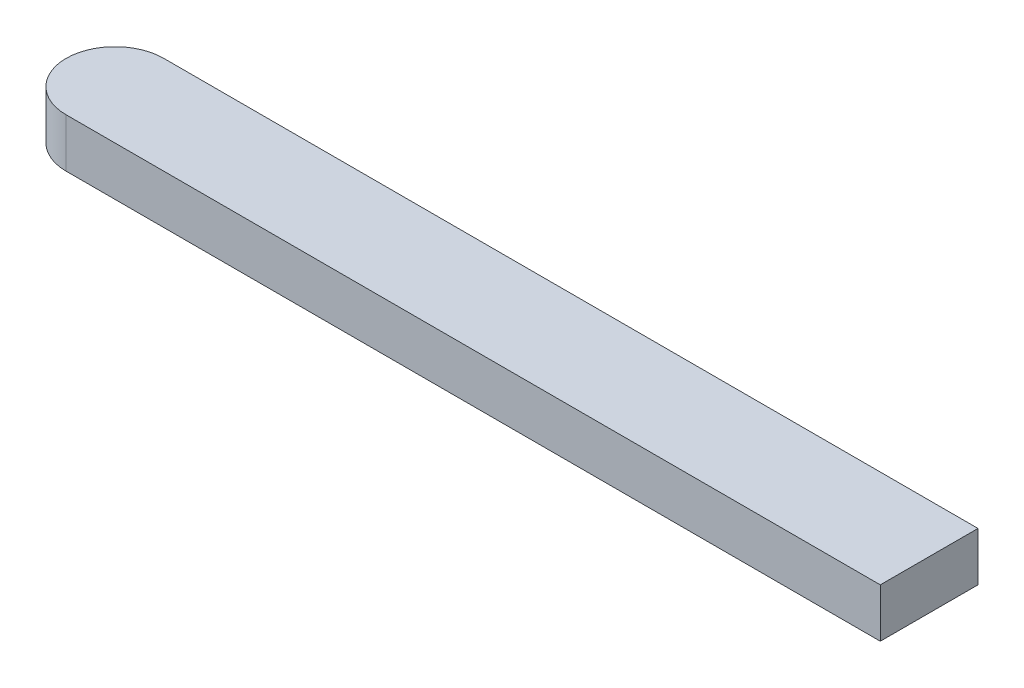
ISO-10303-21;
HEADER;
FILE_DESCRIPTION(('STEP AP214'),'2;1');
FILE_NAME('part.step','',(''),(''),'','','');
FILE_SCHEMA(('AUTOMOTIVE_DESIGN { 1 0 10303 214 1 1 1 1 }'));
ENDSEC;
DATA;
#1=APPLICATION_CONTEXT('core data for automotive mechanical design processes');
#2=APPLICATION_PROTOCOL_DEFINITION('international standard','automotive_design',2000,#1);
#3=PRODUCT_CONTEXT('',#1,'mechanical');
#4=PRODUCT('Part','Part','',(#3));
#5=PRODUCT_RELATED_PRODUCT_CATEGORY('part','',(#4));
#6=PRODUCT_DEFINITION_FORMATION('','',#4);
#7=PRODUCT_DEFINITION_CONTEXT('part definition',#1,'design');
#8=PRODUCT_DEFINITION('design','',#6,#7);
#9=PRODUCT_DEFINITION_SHAPE('','',#8);
#10=(LENGTH_UNIT() NAMED_UNIT(*) SI_UNIT(.MILLI.,.METRE.));
#11=(NAMED_UNIT(*) PLANE_ANGLE_UNIT() SI_UNIT($,.RADIAN.));
#12=(NAMED_UNIT(*) SI_UNIT($,.STERADIAN.) SOLID_ANGLE_UNIT());
#13=UNCERTAINTY_MEASURE_WITH_UNIT(LENGTH_MEASURE(1.E-05),#10,'distance_accuracy_value','');
#14=(GEOMETRIC_REPRESENTATION_CONTEXT(3) GLOBAL_UNCERTAINTY_ASSIGNED_CONTEXT((#13)) GLOBAL_UNIT_ASSIGNED_CONTEXT((#10,
#11,#12)) REPRESENTATION_CONTEXT('',''));
#15=CARTESIAN_POINT('',(0.,0.,0.));
#16=DIRECTION('',(0.,0.,1.));
#17=DIRECTION('',(1.,0.,0.));
#18=AXIS2_PLACEMENT_3D('',#15,#16,#17);
#19=CARTESIAN_POINT('',(0.,3.,0.));
#20=DIRECTION('',(0.,-1.,0.));
#21=DIRECTION('',(0.,0.,-1.));
#22=AXIS2_PLACEMENT_3D('',#19,#20,#21);
#23=CYLINDRICAL_SURFACE('',#22,3.);
#24=CARTESIAN_POINT('',(0.,0.,0.));
#25=DIRECTION('',(0.,1.,0.));
#26=DIRECTION('',(0.,0.,1.));
#27=AXIS2_PLACEMENT_3D('',#24,#25,#26);
#28=CIRCLE('',#27,3.);
#29=CARTESIAN_POINT('',(0.,0.,-3.));
#30=VERTEX_POINT('',#29);
#31=CARTESIAN_POINT('',(0.,0.,3.));
#32=VERTEX_POINT('',#31);
#33=EDGE_CURVE('E117',#30,#32,#28,.T.);
#34=ORIENTED_EDGE('',*,*,#33,.T.);
#35=DIRECTION('',(0.,-1.,0.));
#36=VECTOR('',#35,1.);
#37=CARTESIAN_POINT('',(0.,3.,3.));
#38=LINE('',#37,#36);
#39=CARTESIAN_POINT('',(0.,3.,3.));
#40=VERTEX_POINT('',#39);
#41=EDGE_CURVE('E69',#40,#32,#38,.T.);
#42=ORIENTED_EDGE('',*,*,#41,.F.);
#43=CARTESIAN_POINT('',(0.,3.,0.));
#44=DIRECTION('',(0.,1.,0.));
#45=DIRECTION('',(0.,0.,1.));
#46=AXIS2_PLACEMENT_3D('',#43,#44,#45);
#47=CIRCLE('',#46,3.);
#48=CARTESIAN_POINT('',(0.,3.,-3.));
#49=VERTEX_POINT('',#48);
#50=EDGE_CURVE('E128',#49,#40,#47,.T.);
#51=ORIENTED_EDGE('',*,*,#50,.F.);
#52=DIRECTION('',(0.,-1.,0.));
#53=VECTOR('',#52,1.);
#54=CARTESIAN_POINT('',(0.,3.,-3.));
#55=LINE('',#54,#53);
#56=EDGE_CURVE('E12',#49,#30,#55,.T.);
#57=ORIENTED_EDGE('',*,*,#56,.T.);
#58=EDGE_LOOP('',(#34,#42,#51,#57));
#59=FACE_BOUND('',#58,.T.);
#60=ADVANCED_FACE('F59',(#59),#23,.T.);
#61=CARTESIAN_POINT('',(0.,3.,0.));
#62=DIRECTION('',(0.,1.,0.));
#63=DIRECTION('',(0.,0.,1.));
#64=AXIS2_PLACEMENT_3D('',#61,#62,#63);
#65=PLANE('',#64);
#66=ORIENTED_EDGE('',*,*,#50,.T.);
#67=DIRECTION('',(1.,0.,0.));
#68=VECTOR('',#67,1.);
#69=CARTESIAN_POINT('',(0.,3.,3.));
#70=LINE('',#69,#68);
#71=CARTESIAN_POINT('',(50.,3.,3.));
#72=VERTEX_POINT('',#71);
#73=EDGE_CURVE('E123',#40,#72,#70,.T.);
#74=ORIENTED_EDGE('',*,*,#73,.T.);
#75=DIRECTION('',(0.,0.,-1.));
#76=VECTOR('',#75,1.);
#77=CARTESIAN_POINT('',(50.,3.,3.));
#78=LINE('',#77,#76);
#79=CARTESIAN_POINT('',(50.,3.,-3.));
#80=VERTEX_POINT('',#79);
#81=EDGE_CURVE('E116',#72,#80,#78,.T.);
#82=ORIENTED_EDGE('',*,*,#81,.T.);
#83=DIRECTION('',(1.,0.,0.));
#84=VECTOR('',#83,1.);
#85=CARTESIAN_POINT('',(0.,3.,-3.));
#86=LINE('',#85,#84);
#87=EDGE_CURVE('E110',#49,#80,#86,.T.);
#88=ORIENTED_EDGE('',*,*,#87,.F.);
#89=EDGE_LOOP('',(#66,#74,#82,#88));
#90=FACE_BOUND('',#89,.T.);
#91=ADVANCED_FACE('F133',(#90),#65,.T.);
#92=CARTESIAN_POINT('',(0.,0.,0.));
#93=DIRECTION('',(0.,1.,0.));
#94=DIRECTION('',(0.,0.,1.));
#95=AXIS2_PLACEMENT_3D('',#92,#93,#94);
#96=PLANE('',#95);
#97=ORIENTED_EDGE('',*,*,#33,.F.);
#98=DIRECTION('',(1.,0.,0.));
#99=VECTOR('',#98,1.);
#100=CARTESIAN_POINT('',(0.,0.,-3.));
#101=LINE('',#100,#99);
#102=CARTESIAN_POINT('',(50.,0.,-3.));
#103=VERTEX_POINT('',#102);
#104=EDGE_CURVE('E119',#30,#103,#101,.T.);
#105=ORIENTED_EDGE('',*,*,#104,.T.);
#106=DIRECTION('',(0.,0.,-1.));
#107=VECTOR('',#106,1.);
#108=CARTESIAN_POINT('',(50.,0.,3.));
#109=LINE('',#108,#107);
#110=CARTESIAN_POINT('',(50.,0.,3.));
#111=VERTEX_POINT('',#110);
#112=EDGE_CURVE('E111',#111,#103,#109,.T.);
#113=ORIENTED_EDGE('',*,*,#112,.F.);
#114=DIRECTION('',(1.,0.,0.));
#115=VECTOR('',#114,1.);
#116=CARTESIAN_POINT('',(0.,0.,3.));
#117=LINE('',#116,#115);
#118=EDGE_CURVE('E102',#32,#111,#117,.T.);
#119=ORIENTED_EDGE('',*,*,#118,.F.);
#120=EDGE_LOOP('',(#97,#105,#113,#119));
#121=FACE_BOUND('',#120,.T.);
#122=ADVANCED_FACE('F118',(#121),#96,.F.);
#123=CARTESIAN_POINT('',(0.,3.,3.));
#124=DIRECTION('',(0.,0.,-1.));
#125=DIRECTION('',(-1.,0.,0.));
#126=AXIS2_PLACEMENT_3D('',#123,#124,#125);
#127=PLANE('',#126);
#128=ORIENTED_EDGE('',*,*,#118,.T.);
#129=DIRECTION('',(0.,-1.,0.));
#130=VECTOR('',#129,1.);
#131=CARTESIAN_POINT('',(50.,3.,3.));
#132=LINE('',#131,#130);
#133=EDGE_CURVE('E105',#72,#111,#132,.T.);
#134=ORIENTED_EDGE('',*,*,#133,.F.);
#135=ORIENTED_EDGE('',*,*,#73,.F.);
#136=ORIENTED_EDGE('',*,*,#41,.T.);
#137=EDGE_LOOP('',(#128,#134,#135,#136));
#138=FACE_BOUND('',#137,.T.);
#139=ADVANCED_FACE('F104',(#138),#127,.F.);
#140=CARTESIAN_POINT('',(50.,3.,3.));
#141=DIRECTION('',(-1.,0.,0.));
#142=DIRECTION('',(0.,0.,1.));
#143=AXIS2_PLACEMENT_3D('',#140,#141,#142);
#144=PLANE('',#143);
#145=ORIENTED_EDGE('',*,*,#112,.T.);
#146=DIRECTION('',(0.,-1.,0.));
#147=VECTOR('',#146,1.);
#148=CARTESIAN_POINT('',(50.,3.,-3.));
#149=LINE('',#148,#147);
#150=EDGE_CURVE('E63',#80,#103,#149,.T.);
#151=ORIENTED_EDGE('',*,*,#150,.F.);
#152=ORIENTED_EDGE('',*,*,#81,.F.);
#153=ORIENTED_EDGE('',*,*,#133,.T.);
#154=EDGE_LOOP('',(#145,#151,#152,#153));
#155=FACE_BOUND('',#154,.T.);
#156=ADVANCED_FACE('F114',(#155),#144,.F.);
#157=CARTESIAN_POINT('',(0.,3.,-3.));
#158=DIRECTION('',(0.,0.,-1.));
#159=DIRECTION('',(-1.,0.,0.));
#160=AXIS2_PLACEMENT_3D('',#157,#158,#159);
#161=PLANE('',#160);
#162=ORIENTED_EDGE('',*,*,#104,.F.);
#163=ORIENTED_EDGE('',*,*,#56,.F.);
#164=ORIENTED_EDGE('',*,*,#87,.T.);
#165=ORIENTED_EDGE('',*,*,#150,.T.);
#166=EDGE_LOOP('',(#162,#163,#164,#165));
#167=FACE_BOUND('',#166,.T.);
#168=ADVANCED_FACE('F61',(#167),#161,.T.);
#169=CLOSED_SHELL('',(#60,#91,#122,#139,#156,#168));
#170=MANIFOLD_SOLID_BREP('B2',#169);
#171=ADVANCED_BREP_SHAPE_REPRESENTATION('',(#18,#170),#14);
#172=SHAPE_DEFINITION_REPRESENTATION(#9,#171);
ENDSEC;
END-ISO-10303-21;
